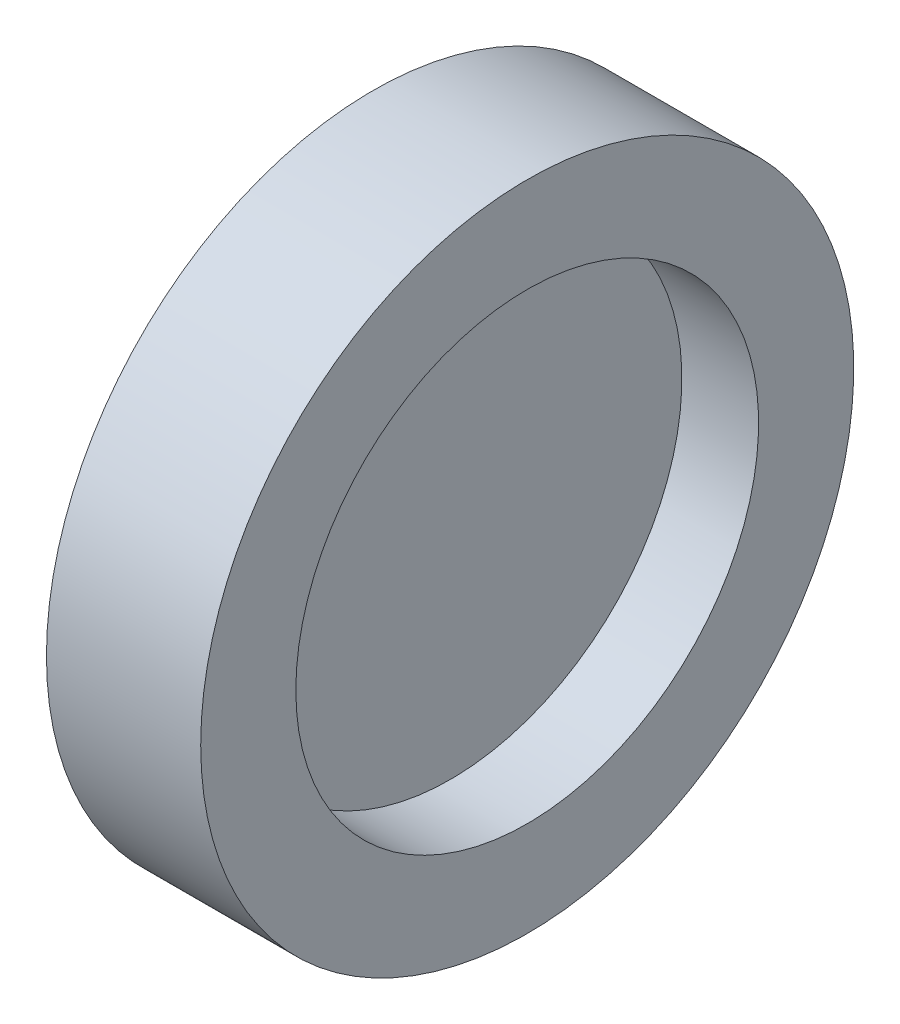
ISO-10303-21;
HEADER;
FILE_DESCRIPTION(('STEP AP214'),'2;1');
FILE_NAME('part.step','',(''),(''),'','','');
FILE_SCHEMA(('AUTOMOTIVE_DESIGN { 1 0 10303 214 1 1 1 1 }'));
ENDSEC;
DATA;
#1=APPLICATION_CONTEXT('core data for automotive mechanical design processes');
#2=APPLICATION_PROTOCOL_DEFINITION('international standard','automotive_design',2000,#1);
#3=PRODUCT_CONTEXT('',#1,'mechanical');
#4=PRODUCT('Part','Part','',(#3));
#5=PRODUCT_RELATED_PRODUCT_CATEGORY('part','',(#4));
#6=PRODUCT_DEFINITION_FORMATION('','',#4);
#7=PRODUCT_DEFINITION_CONTEXT('part definition',#1,'design');
#8=PRODUCT_DEFINITION('design','',#6,#7);
#9=PRODUCT_DEFINITION_SHAPE('','',#8);
#10=(LENGTH_UNIT() NAMED_UNIT(*) SI_UNIT(.MILLI.,.METRE.));
#11=(NAMED_UNIT(*) PLANE_ANGLE_UNIT() SI_UNIT($,.RADIAN.));
#12=(NAMED_UNIT(*) SI_UNIT($,.STERADIAN.) SOLID_ANGLE_UNIT());
#13=UNCERTAINTY_MEASURE_WITH_UNIT(LENGTH_MEASURE(1.E-05),#10,'distance_accuracy_value','');
#14=(GEOMETRIC_REPRESENTATION_CONTEXT(3) GLOBAL_UNCERTAINTY_ASSIGNED_CONTEXT((#13)) GLOBAL_UNIT_ASSIGNED_CONTEXT((#10,
#11,#12)) REPRESENTATION_CONTEXT('',''));
#15=CARTESIAN_POINT('',(0.,0.,0.));
#16=DIRECTION('',(0.,0.,1.));
#17=DIRECTION('',(1.,0.,0.));
#18=AXIS2_PLACEMENT_3D('',#15,#16,#17);
#19=CARTESIAN_POINT('',(0.0150000000000005,9.,0.));
#20=DIRECTION('',(-1.,0.,0.));
#21=DIRECTION('',(0.,0.,1.));
#22=AXIS2_PLACEMENT_3D('',#19,#20,#21);
#23=PLANE('',#22);
#24=CARTESIAN_POINT('',(0.0150000000000011,0.,0.));
#25=DIRECTION('',(-1.,0.,0.));
#26=DIRECTION('',(0.,0.,1.));
#27=AXIS2_PLACEMENT_3D('',#24,#25,#26);
#28=CIRCLE('',#27,9.);
#29=CARTESIAN_POINT('',(0.0150000000000011,0.,9.));
#30=VERTEX_POINT('',#29);
#31=EDGE_CURVE('E10',#30,#30,#28,.T.);
#32=ORIENTED_EDGE('',*,*,#31,.F.);
#33=EDGE_LOOP('',(#32));
#34=FACE_BOUND('',#33,.T.);
#35=ADVANCED_FACE('F37',(#34),#23,.F.);
#36=CARTESIAN_POINT('',(-1.61421241885762,0.,0.));
#37=DIRECTION('',(-1.,0.,0.));
#38=DIRECTION('',(0.,0.,1.));
#39=AXIS2_PLACEMENT_3D('',#36,#37,#38);
#40=CYLINDRICAL_SURFACE('',#39,9.);
#41=CARTESIAN_POINT('',(3.,0.,0.));
#42=DIRECTION('',(-1.,0.,0.));
#43=DIRECTION('',(0.,0.,1.));
#44=AXIS2_PLACEMENT_3D('',#41,#42,#43);
#45=CIRCLE('',#44,9.);
#46=CARTESIAN_POINT('',(3.,0.,9.));
#47=VERTEX_POINT('',#46);
#48=EDGE_CURVE('E60',#47,#47,#45,.T.);
#49=ORIENTED_EDGE('',*,*,#48,.F.);
#50=EDGE_LOOP('',(#49));
#51=FACE_BOUND('',#50,.T.);
#52=ORIENTED_EDGE('',*,*,#31,.T.);
#53=EDGE_LOOP('',(#52));
#54=FACE_BOUND('',#53,.T.);
#55=ADVANCED_FACE('F90',(#51,#54),#40,.F.);
#56=CARTESIAN_POINT('',(-3.,0.,0.));
#57=DIRECTION('',(-1.,0.,0.));
#58=DIRECTION('',(0.,0.,1.));
#59=AXIS2_PLACEMENT_3D('',#56,#57,#58);
#60=CIRCLE('',#59,9.);
#61=CARTESIAN_POINT('',(-3.,0.,9.));
#62=VERTEX_POINT('',#61);
#63=EDGE_CURVE('E64',#62,#62,#60,.T.);
#64=ORIENTED_EDGE('',*,*,#63,.T.);
#65=EDGE_LOOP('',(#64));
#66=FACE_BOUND('',#65,.T.);
#67=CARTESIAN_POINT('',(-0.0150000000000005,0.,0.));
#68=DIRECTION('',(1.,0.,0.));
#69=DIRECTION('',(0.,0.,-1.));
#70=AXIS2_PLACEMENT_3D('',#67,#68,#69);
#71=CIRCLE('',#70,9.);
#72=CARTESIAN_POINT('',(-0.0150000000000005,0.,-9.));
#73=VERTEX_POINT('',#72);
#74=EDGE_CURVE('E44',#73,#73,#71,.T.);
#75=ORIENTED_EDGE('',*,*,#74,.T.);
#76=EDGE_LOOP('',(#75));
#77=FACE_BOUND('',#76,.T.);
#78=ADVANCED_FACE('F69',(#66,#77),#40,.F.);
#79=CARTESIAN_POINT('',(-3.,9.,0.));
#80=DIRECTION('',(1.,0.,0.));
#81=DIRECTION('',(0.,0.,-1.));
#82=AXIS2_PLACEMENT_3D('',#79,#80,#81);
#83=PLANE('',#82);
#84=ORIENTED_EDGE('',*,*,#63,.F.);
#85=EDGE_LOOP('',(#84));
#86=FACE_BOUND('',#85,.T.);
#87=CARTESIAN_POINT('',(-3.,0.,0.));
#88=DIRECTION('',(-1.,0.,0.));
#89=DIRECTION('',(0.,0.,1.));
#90=AXIS2_PLACEMENT_3D('',#87,#88,#89);
#91=CIRCLE('',#90,12.7);
#92=CARTESIAN_POINT('',(-3.,0.,12.7));
#93=VERTEX_POINT('',#92);
#94=EDGE_CURVE('E49',#93,#93,#91,.T.);
#95=ORIENTED_EDGE('',*,*,#94,.T.);
#96=EDGE_LOOP('',(#95));
#97=FACE_BOUND('',#96,.T.);
#98=ADVANCED_FACE('F71',(#86,#97),#83,.F.);
#99=CARTESIAN_POINT('',(-1.61421241885762,0.,0.));
#100=DIRECTION('',(-1.,0.,0.));
#101=DIRECTION('',(0.,0.,1.));
#102=AXIS2_PLACEMENT_3D('',#99,#100,#101);
#103=CYLINDRICAL_SURFACE('',#102,12.7);
#104=ORIENTED_EDGE('',*,*,#94,.F.);
#105=EDGE_LOOP('',(#104));
#106=FACE_BOUND('',#105,.T.);
#107=CARTESIAN_POINT('',(3.,0.,0.));
#108=DIRECTION('',(-1.,0.,0.));
#109=DIRECTION('',(0.,0.,1.));
#110=AXIS2_PLACEMENT_3D('',#107,#108,#109);
#111=CIRCLE('',#110,12.7);
#112=CARTESIAN_POINT('',(3.,0.,12.7));
#113=VERTEX_POINT('',#112);
#114=EDGE_CURVE('E54',#113,#113,#111,.T.);
#115=ORIENTED_EDGE('',*,*,#114,.T.);
#116=EDGE_LOOP('',(#115));
#117=FACE_BOUND('',#116,.T.);
#118=ADVANCED_FACE('F74',(#106,#117),#103,.T.);
#119=CARTESIAN_POINT('',(3.,12.7,0.));
#120=DIRECTION('',(-1.,0.,0.));
#121=DIRECTION('',(0.,0.,1.));
#122=AXIS2_PLACEMENT_3D('',#119,#120,#121);
#123=PLANE('',#122);
#124=ORIENTED_EDGE('',*,*,#114,.F.);
#125=EDGE_LOOP('',(#124));
#126=FACE_BOUND('',#125,.T.);
#127=ORIENTED_EDGE('',*,*,#48,.T.);
#128=EDGE_LOOP('',(#127));
#129=FACE_BOUND('',#128,.T.);
#130=ADVANCED_FACE('F80',(#126,#129),#123,.F.);
#131=CARTESIAN_POINT('',(-0.0150000000000005,9.,0.));
#132=DIRECTION('',(1.,0.,0.));
#133=DIRECTION('',(0.,0.,-1.));
#134=AXIS2_PLACEMENT_3D('',#131,#132,#133);
#135=PLANE('',#134);
#136=ORIENTED_EDGE('',*,*,#74,.F.);
#137=EDGE_LOOP('',(#136));
#138=FACE_BOUND('',#137,.T.);
#139=ADVANCED_FACE('F86',(#138),#135,.F.);
#140=CLOSED_SHELL('',(#35,#55,#78,#98,#118,#130,#139));
#141=MANIFOLD_SOLID_BREP('B2',#140);
#142=ADVANCED_BREP_SHAPE_REPRESENTATION('',(#18,#141),#14);
#143=SHAPE_DEFINITION_REPRESENTATION(#9,#142);
ENDSEC;
END-ISO-10303-21;
